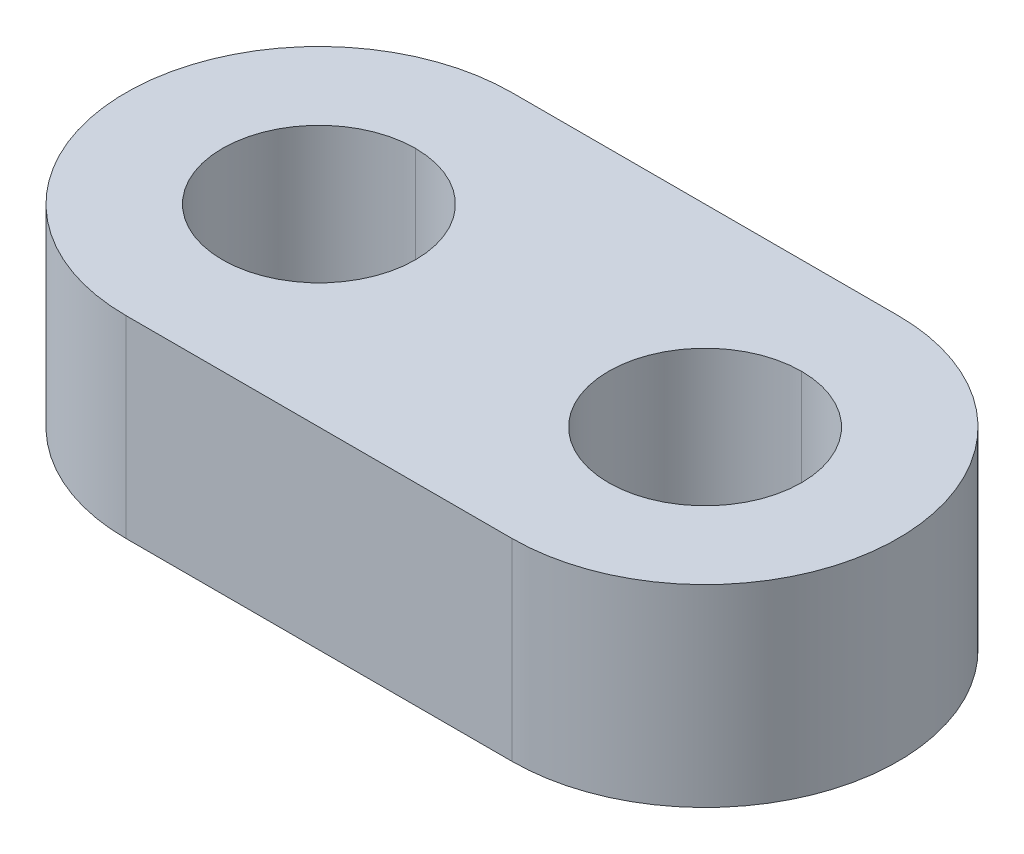
ISO-10303-21;
HEADER;
FILE_DESCRIPTION(('STEP AP214'),'2;1');
FILE_NAME('part.step','',(''),(''),'','','');
FILE_SCHEMA(('AUTOMOTIVE_DESIGN { 1 0 10303 214 1 1 1 1 }'));
ENDSEC;
DATA;
#1=APPLICATION_CONTEXT('core data for automotive mechanical design processes');
#2=APPLICATION_PROTOCOL_DEFINITION('international standard','automotive_design',2000,#1);
#3=PRODUCT_CONTEXT('',#1,'mechanical');
#4=PRODUCT('Part','Part','',(#3));
#5=PRODUCT_RELATED_PRODUCT_CATEGORY('part','',(#4));
#6=PRODUCT_DEFINITION_FORMATION('','',#4);
#7=PRODUCT_DEFINITION_CONTEXT('part definition',#1,'design');
#8=PRODUCT_DEFINITION('design','',#6,#7);
#9=PRODUCT_DEFINITION_SHAPE('','',#8);
#10=(LENGTH_UNIT() NAMED_UNIT(*) SI_UNIT(.MILLI.,.METRE.));
#11=(NAMED_UNIT(*) PLANE_ANGLE_UNIT() SI_UNIT($,.RADIAN.));
#12=(NAMED_UNIT(*) SI_UNIT($,.STERADIAN.) SOLID_ANGLE_UNIT());
#13=UNCERTAINTY_MEASURE_WITH_UNIT(LENGTH_MEASURE(1.E-05),#10,'distance_accuracy_value','');
#14=(GEOMETRIC_REPRESENTATION_CONTEXT(3) GLOBAL_UNCERTAINTY_ASSIGNED_CONTEXT((#13)) GLOBAL_UNIT_ASSIGNED_CONTEXT((#10,
#11,#12)) REPRESENTATION_CONTEXT('',''));
#15=CARTESIAN_POINT('',(0.,0.,0.));
#16=DIRECTION('',(0.,0.,1.));
#17=DIRECTION('',(1.,0.,0.));
#18=AXIS2_PLACEMENT_3D('',#15,#16,#17);
#19=CARTESIAN_POINT('',(4.,4.,0.));
#20=DIRECTION('',(0.,1.,0.));
#21=DIRECTION('',(0.,0.,1.));
#22=AXIS2_PLACEMENT_3D('',#19,#20,#21);
#23=CYLINDRICAL_SURFACE('',#22,2.);
#24=DIRECTION('',(0.,1.,0.));
#25=VECTOR('',#24,1.);
#26=CARTESIAN_POINT('',(4.,4.,-2.));
#27=LINE('',#26,#25);
#28=CARTESIAN_POINT('',(4.,0.,-2.));
#29=VERTEX_POINT('',#28);
#30=CARTESIAN_POINT('',(4.,4.,-2.));
#31=VERTEX_POINT('',#30);
#32=EDGE_CURVE('E130',#29,#31,#27,.T.);
#33=ORIENTED_EDGE('',*,*,#32,.F.);
#34=CARTESIAN_POINT('',(4.,0.,0.));
#35=DIRECTION('',(0.,1.,0.));
#36=DIRECTION('',(0.,0.,1.));
#37=AXIS2_PLACEMENT_3D('',#34,#35,#36);
#38=CIRCLE('',#37,2.);
#39=CARTESIAN_POINT('',(4.,0.,2.));
#40=VERTEX_POINT('',#39);
#41=EDGE_CURVE('E24',#40,#29,#38,.T.);
#42=ORIENTED_EDGE('',*,*,#41,.F.);
#43=DIRECTION('',(0.,1.,0.));
#44=VECTOR('',#43,1.);
#45=CARTESIAN_POINT('',(4.,4.,2.));
#46=LINE('',#45,#44);
#47=CARTESIAN_POINT('',(4.,4.,2.));
#48=VERTEX_POINT('',#47);
#49=EDGE_CURVE('E132',#40,#48,#46,.T.);
#50=ORIENTED_EDGE('',*,*,#49,.T.);
#51=CARTESIAN_POINT('',(4.,4.,0.));
#52=DIRECTION('',(0.,1.,0.));
#53=DIRECTION('',(0.,0.,1.));
#54=AXIS2_PLACEMENT_3D('',#51,#52,#53);
#55=CIRCLE('',#54,2.);
#56=EDGE_CURVE('E127',#48,#31,#55,.T.);
#57=ORIENTED_EDGE('',*,*,#56,.T.);
#58=EDGE_LOOP('',(#33,#42,#50,#57));
#59=FACE_BOUND('',#58,.T.);
#60=ADVANCED_FACE('F14',(#59),#23,.F.);
#61=CARTESIAN_POINT('',(-4.,4.,0.));
#62=DIRECTION('',(0.,1.,0.));
#63=DIRECTION('',(0.,0.,1.));
#64=AXIS2_PLACEMENT_3D('',#61,#62,#63);
#65=CYLINDRICAL_SURFACE('',#64,2.);
#66=DIRECTION('',(0.,1.,0.));
#67=VECTOR('',#66,1.);
#68=CARTESIAN_POINT('',(-4.,4.,-2.));
#69=LINE('',#68,#67);
#70=CARTESIAN_POINT('',(-4.,0.,-2.));
#71=VERTEX_POINT('',#70);
#72=CARTESIAN_POINT('',(-4.,4.,-2.));
#73=VERTEX_POINT('',#72);
#74=EDGE_CURVE('E161',#71,#73,#69,.T.);
#75=ORIENTED_EDGE('',*,*,#74,.F.);
#76=CARTESIAN_POINT('',(-4.,0.,0.));
#77=DIRECTION('',(0.,1.,0.));
#78=DIRECTION('',(0.,0.,1.));
#79=AXIS2_PLACEMENT_3D('',#76,#77,#78);
#80=CIRCLE('',#79,2.);
#81=CARTESIAN_POINT('',(-4.,0.,2.));
#82=VERTEX_POINT('',#81);
#83=EDGE_CURVE('E9',#82,#71,#80,.T.);
#84=ORIENTED_EDGE('',*,*,#83,.F.);
#85=DIRECTION('',(0.,1.,0.));
#86=VECTOR('',#85,1.);
#87=CARTESIAN_POINT('',(-4.,4.,2.));
#88=LINE('',#87,#86);
#89=CARTESIAN_POINT('',(-4.,4.,2.));
#90=VERTEX_POINT('',#89);
#91=EDGE_CURVE('E160',#82,#90,#88,.T.);
#92=ORIENTED_EDGE('',*,*,#91,.T.);
#93=CARTESIAN_POINT('',(-4.,4.,0.));
#94=DIRECTION('',(0.,1.,0.));
#95=DIRECTION('',(0.,0.,1.));
#96=AXIS2_PLACEMENT_3D('',#93,#94,#95);
#97=CIRCLE('',#96,2.);
#98=EDGE_CURVE('E109',#90,#73,#97,.T.);
#99=ORIENTED_EDGE('',*,*,#98,.T.);
#100=EDGE_LOOP('',(#75,#84,#92,#99));
#101=FACE_BOUND('',#100,.T.);
#102=ADVANCED_FACE('F233',(#101),#65,.F.);
#103=CARTESIAN_POINT('',(-4.,0.,0.));
#104=DIRECTION('',(0.,1.,0.));
#105=DIRECTION('',(1.,0.,0.));
#106=AXIS2_PLACEMENT_3D('',#103,#104,#105);
#107=PLANE('',#106);
#108=ORIENTED_EDGE('',*,*,#83,.T.);
#109=CARTESIAN_POINT('',(-4.,0.,0.));
#110=DIRECTION('',(0.,1.,0.));
#111=DIRECTION('',(0.,0.,1.));
#112=AXIS2_PLACEMENT_3D('',#109,#110,#111);
#113=CIRCLE('',#112,2.);
#114=EDGE_CURVE('E212',#71,#82,#113,.T.);
#115=ORIENTED_EDGE('',*,*,#114,.T.);
#116=EDGE_LOOP('',(#108,#115));
#117=FACE_BOUND('',#116,.T.);
#118=ORIENTED_EDGE('',*,*,#41,.T.);
#119=CARTESIAN_POINT('',(4.,0.,0.));
#120=DIRECTION('',(0.,1.,0.));
#121=DIRECTION('',(0.,0.,1.));
#122=AXIS2_PLACEMENT_3D('',#119,#120,#121);
#123=CIRCLE('',#122,2.);
#124=EDGE_CURVE('E145',#29,#40,#123,.T.);
#125=ORIENTED_EDGE('',*,*,#124,.T.);
#126=EDGE_LOOP('',(#118,#125));
#127=FACE_BOUND('',#126,.T.);
#128=CARTESIAN_POINT('',(-4.,0.,0.));
#129=DIRECTION('',(0.,1.,0.));
#130=DIRECTION('',(0.,0.,1.));
#131=AXIS2_PLACEMENT_3D('',#128,#129,#130);
#132=CIRCLE('',#131,4.);
#133=CARTESIAN_POINT('',(-4.,0.,-4.));
#134=VERTEX_POINT('',#133);
#135=CARTESIAN_POINT('',(-4.,0.,4.));
#136=VERTEX_POINT('',#135);
#137=EDGE_CURVE('E183',#134,#136,#132,.T.);
#138=ORIENTED_EDGE('',*,*,#137,.F.);
#139=DIRECTION('',(-1.,0.,0.));
#140=VECTOR('',#139,1.);
#141=CARTESIAN_POINT('',(-4.,0.,-4.));
#142=LINE('',#141,#140);
#143=CARTESIAN_POINT('',(4.,0.,-4.));
#144=VERTEX_POINT('',#143);
#145=EDGE_CURVE('E99',#144,#134,#142,.T.);
#146=ORIENTED_EDGE('',*,*,#145,.F.);
#147=CARTESIAN_POINT('',(4.,0.,0.));
#148=DIRECTION('',(0.,1.,0.));
#149=DIRECTION('',(0.,0.,1.));
#150=AXIS2_PLACEMENT_3D('',#147,#148,#149);
#151=CIRCLE('',#150,4.);
#152=CARTESIAN_POINT('',(4.,0.,4.));
#153=VERTEX_POINT('',#152);
#154=EDGE_CURVE('E174',#153,#144,#151,.T.);
#155=ORIENTED_EDGE('',*,*,#154,.F.);
#156=DIRECTION('',(1.,0.,0.));
#157=VECTOR('',#156,1.);
#158=CARTESIAN_POINT('',(-4.,0.,4.));
#159=LINE('',#158,#157);
#160=EDGE_CURVE('E89',#136,#153,#159,.T.);
#161=ORIENTED_EDGE('',*,*,#160,.F.);
#162=EDGE_LOOP('',(#138,#146,#155,#161));
#163=FACE_BOUND('',#162,.T.);
#164=ADVANCED_FACE('F230',(#117,#127,#163),#107,.F.);
#165=CARTESIAN_POINT('',(-4.,4.,0.));
#166=DIRECTION('',(0.,1.,0.));
#167=DIRECTION('',(1.,0.,0.));
#168=AXIS2_PLACEMENT_3D('',#165,#166,#167);
#169=PLANE('',#168);
#170=ORIENTED_EDGE('',*,*,#98,.F.);
#171=CARTESIAN_POINT('',(-4.,4.,0.));
#172=DIRECTION('',(0.,1.,0.));
#173=DIRECTION('',(0.,0.,1.));
#174=AXIS2_PLACEMENT_3D('',#171,#172,#173);
#175=CIRCLE('',#174,2.);
#176=EDGE_CURVE('E157',#73,#90,#175,.T.);
#177=ORIENTED_EDGE('',*,*,#176,.F.);
#178=EDGE_LOOP('',(#170,#177));
#179=FACE_BOUND('',#178,.T.);
#180=ORIENTED_EDGE('',*,*,#56,.F.);
#181=CARTESIAN_POINT('',(4.,4.,0.));
#182=DIRECTION('',(0.,1.,0.));
#183=DIRECTION('',(0.,0.,1.));
#184=AXIS2_PLACEMENT_3D('',#181,#182,#183);
#185=CIRCLE('',#184,2.);
#186=EDGE_CURVE('E137',#31,#48,#185,.T.);
#187=ORIENTED_EDGE('',*,*,#186,.F.);
#188=EDGE_LOOP('',(#180,#187));
#189=FACE_BOUND('',#188,.T.);
#190=CARTESIAN_POINT('',(-4.,4.,0.));
#191=DIRECTION('',(0.,1.,0.));
#192=DIRECTION('',(0.,0.,1.));
#193=AXIS2_PLACEMENT_3D('',#190,#191,#192);
#194=CIRCLE('',#193,4.);
#195=CARTESIAN_POINT('',(-4.,4.,-4.));
#196=VERTEX_POINT('',#195);
#197=CARTESIAN_POINT('',(-4.,4.,4.));
#198=VERTEX_POINT('',#197);
#199=EDGE_CURVE('E164',#196,#198,#194,.T.);
#200=ORIENTED_EDGE('',*,*,#199,.T.);
#201=DIRECTION('',(1.,0.,0.));
#202=VECTOR('',#201,1.);
#203=CARTESIAN_POINT('',(-4.,4.,4.));
#204=LINE('',#203,#202);
#205=CARTESIAN_POINT('',(4.,4.,4.));
#206=VERTEX_POINT('',#205);
#207=EDGE_CURVE('E175',#198,#206,#204,.T.);
#208=ORIENTED_EDGE('',*,*,#207,.T.);
#209=CARTESIAN_POINT('',(4.,4.,0.));
#210=DIRECTION('',(0.,1.,0.));
#211=DIRECTION('',(0.,0.,1.));
#212=AXIS2_PLACEMENT_3D('',#209,#210,#211);
#213=CIRCLE('',#212,4.);
#214=CARTESIAN_POINT('',(4.,4.,-4.));
#215=VERTEX_POINT('',#214);
#216=EDGE_CURVE('E173',#206,#215,#213,.T.);
#217=ORIENTED_EDGE('',*,*,#216,.T.);
#218=DIRECTION('',(-1.,0.,0.));
#219=VECTOR('',#218,1.);
#220=CARTESIAN_POINT('',(-4.,4.,-4.));
#221=LINE('',#220,#219);
#222=EDGE_CURVE('E38',#215,#196,#221,.T.);
#223=ORIENTED_EDGE('',*,*,#222,.T.);
#224=EDGE_LOOP('',(#200,#208,#217,#223));
#225=FACE_BOUND('',#224,.T.);
#226=ADVANCED_FACE('F138',(#179,#189,#225),#169,.T.);
#227=CARTESIAN_POINT('',(-4.,4.,-4.));
#228=DIRECTION('',(0.,0.,1.));
#229=DIRECTION('',(1.,0.,0.));
#230=AXIS2_PLACEMENT_3D('',#227,#228,#229);
#231=PLANE('',#230);
#232=ORIENTED_EDGE('',*,*,#145,.T.);
#233=DIRECTION('',(0.,-1.,0.));
#234=VECTOR('',#233,1.);
#235=CARTESIAN_POINT('',(-4.,4.,-4.));
#236=LINE('',#235,#234);
#237=EDGE_CURVE('E168',#196,#134,#236,.T.);
#238=ORIENTED_EDGE('',*,*,#237,.F.);
#239=ORIENTED_EDGE('',*,*,#222,.F.);
#240=DIRECTION('',(0.,-1.,0.));
#241=VECTOR('',#240,1.);
#242=CARTESIAN_POINT('',(4.,4.,-4.));
#243=LINE('',#242,#241);
#244=EDGE_CURVE('E170',#215,#144,#243,.T.);
#245=ORIENTED_EDGE('',*,*,#244,.T.);
#246=EDGE_LOOP('',(#232,#238,#239,#245));
#247=FACE_BOUND('',#246,.T.);
#248=ADVANCED_FACE('F16',(#247),#231,.F.);
#249=CARTESIAN_POINT('',(4.,4.,0.));
#250=DIRECTION('',(0.,-1.,0.));
#251=DIRECTION('',(0.,0.,-1.));
#252=AXIS2_PLACEMENT_3D('',#249,#250,#251);
#253=CYLINDRICAL_SURFACE('',#252,4.);
#254=ORIENTED_EDGE('',*,*,#154,.T.);
#255=ORIENTED_EDGE('',*,*,#244,.F.);
#256=ORIENTED_EDGE('',*,*,#216,.F.);
#257=DIRECTION('',(0.,-1.,0.));
#258=VECTOR('',#257,1.);
#259=CARTESIAN_POINT('',(4.,4.,4.));
#260=LINE('',#259,#258);
#261=EDGE_CURVE('E179',#206,#153,#260,.T.);
#262=ORIENTED_EDGE('',*,*,#261,.T.);
#263=EDGE_LOOP('',(#254,#255,#256,#262));
#264=FACE_BOUND('',#263,.T.);
#265=ADVANCED_FACE('F221',(#264),#253,.T.);
#266=CARTESIAN_POINT('',(-4.,4.,4.));
#267=DIRECTION('',(0.,0.,-1.));
#268=DIRECTION('',(0.,-1.,0.));
#269=AXIS2_PLACEMENT_3D('',#266,#267,#268);
#270=PLANE('',#269);
#271=ORIENTED_EDGE('',*,*,#160,.T.);
#272=ORIENTED_EDGE('',*,*,#261,.F.);
#273=ORIENTED_EDGE('',*,*,#207,.F.);
#274=DIRECTION('',(0.,-1.,0.));
#275=VECTOR('',#274,1.);
#276=CARTESIAN_POINT('',(-4.,4.,4.));
#277=LINE('',#276,#275);
#278=EDGE_CURVE('E169',#198,#136,#277,.T.);
#279=ORIENTED_EDGE('',*,*,#278,.T.);
#280=EDGE_LOOP('',(#271,#272,#273,#279));
#281=FACE_BOUND('',#280,.T.);
#282=ADVANCED_FACE('F228',(#281),#270,.F.);
#283=CARTESIAN_POINT('',(-4.,4.,0.));
#284=DIRECTION('',(0.,-1.,0.));
#285=DIRECTION('',(0.,0.,-1.));
#286=AXIS2_PLACEMENT_3D('',#283,#284,#285);
#287=CYLINDRICAL_SURFACE('',#286,4.);
#288=ORIENTED_EDGE('',*,*,#137,.T.);
#289=ORIENTED_EDGE('',*,*,#278,.F.);
#290=ORIENTED_EDGE('',*,*,#199,.F.);
#291=ORIENTED_EDGE('',*,*,#237,.T.);
#292=EDGE_LOOP('',(#288,#289,#290,#291));
#293=FACE_BOUND('',#292,.T.);
#294=ADVANCED_FACE('F245',(#293),#287,.T.);
#295=CARTESIAN_POINT('',(-4.,4.,0.));
#296=DIRECTION('',(0.,1.,0.));
#297=DIRECTION('',(0.,0.,1.));
#298=AXIS2_PLACEMENT_3D('',#295,#296,#297);
#299=CYLINDRICAL_SURFACE('',#298,2.);
#300=ORIENTED_EDGE('',*,*,#114,.F.);
#301=ORIENTED_EDGE('',*,*,#74,.T.);
#302=ORIENTED_EDGE('',*,*,#176,.T.);
#303=ORIENTED_EDGE('',*,*,#91,.F.);
#304=EDGE_LOOP('',(#300,#301,#302,#303));
#305=FACE_BOUND('',#304,.T.);
#306=ADVANCED_FACE('F243',(#305),#299,.F.);
#307=CARTESIAN_POINT('',(4.,4.,0.));
#308=DIRECTION('',(0.,1.,0.));
#309=DIRECTION('',(0.,0.,1.));
#310=AXIS2_PLACEMENT_3D('',#307,#308,#309);
#311=CYLINDRICAL_SURFACE('',#310,2.);
#312=ORIENTED_EDGE('',*,*,#124,.F.);
#313=ORIENTED_EDGE('',*,*,#32,.T.);
#314=ORIENTED_EDGE('',*,*,#186,.T.);
#315=ORIENTED_EDGE('',*,*,#49,.F.);
#316=EDGE_LOOP('',(#312,#313,#314,#315));
#317=FACE_BOUND('',#316,.T.);
#318=ADVANCED_FACE('F143',(#317),#311,.F.);
#319=CLOSED_SHELL('',(#60,#102,#164,#226,#248,#265,#282,#294,#306,#318));
#320=MANIFOLD_SOLID_BREP('B1',#319);
#321=ADVANCED_BREP_SHAPE_REPRESENTATION('',(#18,#320),#14);
#322=SHAPE_DEFINITION_REPRESENTATION(#9,#321);
ENDSEC;
END-ISO-10303-21;
